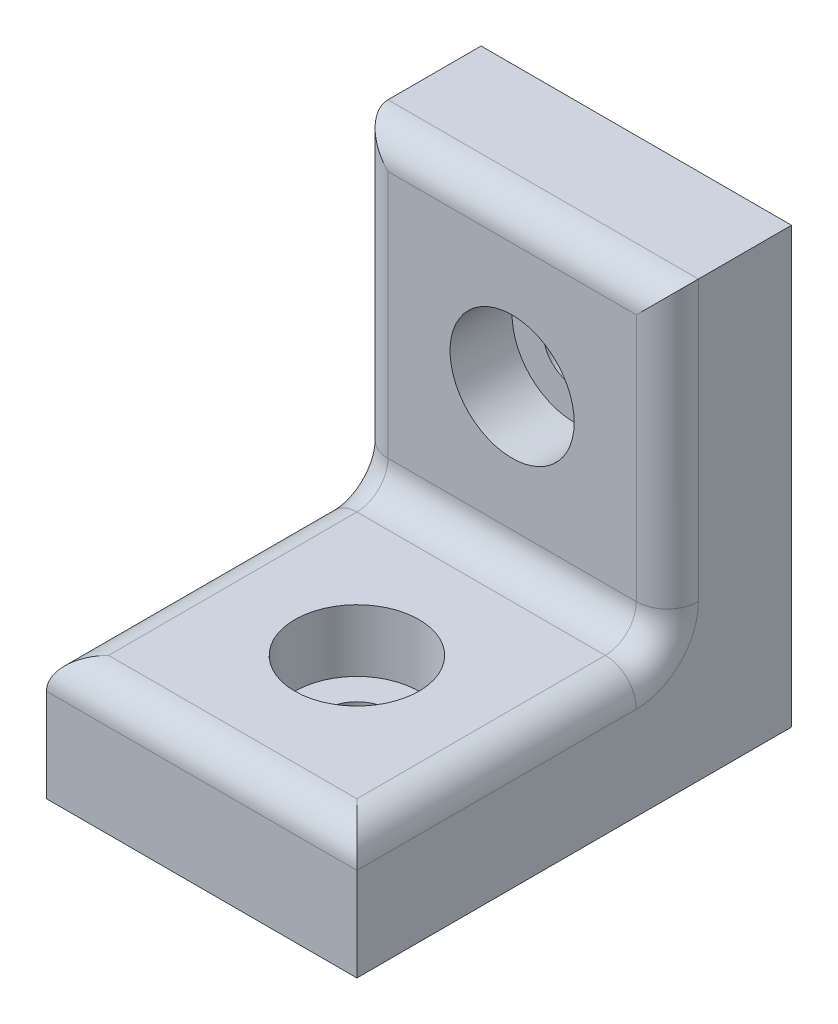
ISO-10303-21;
HEADER;
FILE_DESCRIPTION(('STEP AP214'),'2;1');
FILE_NAME('part.step','',(''),(''),'','','');
FILE_SCHEMA(('AUTOMOTIVE_DESIGN { 1 0 10303 214 1 1 1 1 }'));
ENDSEC;
DATA;
#1=APPLICATION_CONTEXT('core data for automotive mechanical design processes');
#2=APPLICATION_PROTOCOL_DEFINITION('international standard','automotive_design',2000,#1);
#3=PRODUCT_CONTEXT('',#1,'mechanical');
#4=PRODUCT('Part','Part','',(#3));
#5=PRODUCT_RELATED_PRODUCT_CATEGORY('part','',(#4));
#6=PRODUCT_DEFINITION_FORMATION('','',#4);
#7=PRODUCT_DEFINITION_CONTEXT('part definition',#1,'design');
#8=PRODUCT_DEFINITION('design','',#6,#7);
#9=PRODUCT_DEFINITION_SHAPE('','',#8);
#10=(LENGTH_UNIT() NAMED_UNIT(*) SI_UNIT(.MILLI.,.METRE.));
#11=(NAMED_UNIT(*) PLANE_ANGLE_UNIT() SI_UNIT($,.RADIAN.));
#12=(NAMED_UNIT(*) SI_UNIT($,.STERADIAN.) SOLID_ANGLE_UNIT());
#13=UNCERTAINTY_MEASURE_WITH_UNIT(LENGTH_MEASURE(1.E-05),#10,'distance_accuracy_value','');
#14=(GEOMETRIC_REPRESENTATION_CONTEXT(3) GLOBAL_UNCERTAINTY_ASSIGNED_CONTEXT((#13)) GLOBAL_UNIT_ASSIGNED_CONTEXT((#10,
#11,#12)) REPRESENTATION_CONTEXT('',''));
#15=CARTESIAN_POINT('',(0.,0.,0.));
#16=DIRECTION('',(0.,0.,1.));
#17=DIRECTION('',(1.,0.,0.));
#18=AXIS2_PLACEMENT_3D('',#15,#16,#17);
#19=CARTESIAN_POINT('',(0.,0.,9.));
#20=DIRECTION('',(0.,1.,0.));
#21=DIRECTION('',(0.,0.,1.));
#22=AXIS2_PLACEMENT_3D('',#19,#20,#21);
#23=CYLINDRICAL_SURFACE('',#22,1.);
#24=CARTESIAN_POINT('',(0.,0.,9.));
#25=DIRECTION('',(0.,1.,0.));
#26=DIRECTION('',(0.,0.,1.));
#27=AXIS2_PLACEMENT_3D('',#24,#25,#26);
#28=CIRCLE('',#27,1.);
#29=CARTESIAN_POINT('',(0.,0.,10.));
#30=VERTEX_POINT('',#29);
#31=EDGE_CURVE('E200',#30,#30,#28,.T.);
#32=ORIENTED_EDGE('',*,*,#31,.F.);
#33=EDGE_LOOP('',(#32));
#34=FACE_BOUND('',#33,.T.);
#35=CARTESIAN_POINT('',(0.,2.,9.));
#36=DIRECTION('',(0.,1.,0.));
#37=DIRECTION('',(0.,0.,1.));
#38=AXIS2_PLACEMENT_3D('',#35,#36,#37);
#39=CIRCLE('',#38,1.);
#40=CARTESIAN_POINT('',(0.,2.,10.));
#41=VERTEX_POINT('',#40);
#42=EDGE_CURVE('E42',#41,#41,#39,.F.);
#43=ORIENTED_EDGE('',*,*,#42,.F.);
#44=EDGE_LOOP('',(#43));
#45=FACE_BOUND('',#44,.T.);
#46=ADVANCED_FACE('F38',(#34,#45),#23,.F.);
#47=CARTESIAN_POINT('',(0.,9.,0.));
#48=DIRECTION('',(0.,0.,1.));
#49=DIRECTION('',(1.,0.,0.));
#50=AXIS2_PLACEMENT_3D('',#47,#48,#49);
#51=CYLINDRICAL_SURFACE('',#50,1.);
#52=CARTESIAN_POINT('',(0.,9.,0.));
#53=DIRECTION('',(0.,0.,1.));
#54=DIRECTION('',(1.,0.,0.));
#55=AXIS2_PLACEMENT_3D('',#52,#53,#54);
#56=CIRCLE('',#55,1.);
#57=CARTESIAN_POINT('',(1.,9.,0.));
#58=VERTEX_POINT('',#57);
#59=EDGE_CURVE('E135',#58,#58,#56,.T.);
#60=ORIENTED_EDGE('',*,*,#59,.F.);
#61=EDGE_LOOP('',(#60));
#62=FACE_BOUND('',#61,.T.);
#63=CARTESIAN_POINT('',(0.,9.,2.));
#64=DIRECTION('',(0.,0.,1.));
#65=DIRECTION('',(1.,0.,0.));
#66=AXIS2_PLACEMENT_3D('',#63,#64,#65);
#67=CIRCLE('',#66,1.);
#68=CARTESIAN_POINT('',(1.,9.,2.));
#69=VERTEX_POINT('',#68);
#70=EDGE_CURVE('E224',#69,#69,#67,.F.);
#71=ORIENTED_EDGE('',*,*,#70,.F.);
#72=EDGE_LOOP('',(#71));
#73=FACE_BOUND('',#72,.T.);
#74=ADVANCED_FACE('F247',(#62,#73),#51,.F.);
#75=CARTESIAN_POINT('',(-5.,14.,4.));
#76=DIRECTION('',(1.,0.,0.));
#77=DIRECTION('',(0.,1.,0.));
#78=AXIS2_PLACEMENT_3D('',#75,#76,#77);
#79=PLANE('',#78);
#80=CARTESIAN_POINT('',(-5.,5.,5.));
#81=DIRECTION('',(1.,0.,0.));
#82=DIRECTION('',(0.,1.,0.));
#83=AXIS2_PLACEMENT_3D('',#80,#81,#82);
#84=CIRCLE('',#83,2.);
#85=CARTESIAN_POINT('',(-5.,5.,3.));
#86=VERTEX_POINT('',#85);
#87=CARTESIAN_POINT('',(-5.,3.,5.));
#88=VERTEX_POINT('',#87);
#89=EDGE_CURVE('E184',#86,#88,#84,.F.);
#90=ORIENTED_EDGE('',*,*,#89,.F.);
#91=DIRECTION('',(0.,-1.,0.));
#92=VECTOR('',#91,1.);
#93=CARTESIAN_POINT('',(-5.,14.,3.));
#94=LINE('',#93,#92);
#95=CARTESIAN_POINT('',(-5.,14.,3.));
#96=VERTEX_POINT('',#95);
#97=EDGE_CURVE('E189',#86,#96,#94,.F.);
#98=ORIENTED_EDGE('',*,*,#97,.T.);
#99=DIRECTION('',(0.,0.,-1.));
#100=VECTOR('',#99,1.);
#101=CARTESIAN_POINT('',(-5.,14.,4.));
#102=LINE('',#101,#100);
#103=CARTESIAN_POINT('',(-5.,14.,0.));
#104=VERTEX_POINT('',#103);
#105=EDGE_CURVE('E163',#96,#104,#102,.T.);
#106=ORIENTED_EDGE('',*,*,#105,.T.);
#107=DIRECTION('',(0.,-1.,0.));
#108=VECTOR('',#107,1.);
#109=CARTESIAN_POINT('',(-5.,14.,0.));
#110=LINE('',#109,#108);
#111=CARTESIAN_POINT('',(-5.,0.,0.));
#112=VERTEX_POINT('',#111);
#113=EDGE_CURVE('E142',#104,#112,#110,.T.);
#114=ORIENTED_EDGE('',*,*,#113,.T.);
#115=DIRECTION('',(0.,0.,-1.));
#116=VECTOR('',#115,1.);
#117=CARTESIAN_POINT('',(-5.,0.,4.));
#118=LINE('',#117,#116);
#119=CARTESIAN_POINT('',(-5.,0.,14.));
#120=VERTEX_POINT('',#119);
#121=EDGE_CURVE('E139',#120,#112,#118,.T.);
#122=ORIENTED_EDGE('',*,*,#121,.F.);
#123=DIRECTION('',(0.,-1.,0.));
#124=VECTOR('',#123,1.);
#125=CARTESIAN_POINT('',(-5.,0.,14.));
#126=LINE('',#125,#124);
#127=CARTESIAN_POINT('',(-5.,3.,14.));
#128=VERTEX_POINT('',#127);
#129=EDGE_CURVE('E124',#128,#120,#126,.T.);
#130=ORIENTED_EDGE('',*,*,#129,.F.);
#131=DIRECTION('',(0.,0.,-1.));
#132=VECTOR('',#131,1.);
#133=CARTESIAN_POINT('',(-5.,3.,4.));
#134=LINE('',#133,#132);
#135=EDGE_CURVE('E187',#128,#88,#134,.T.);
#136=ORIENTED_EDGE('',*,*,#135,.T.);
#137=EDGE_LOOP('',(#90,#98,#106,#114,#122,#130,#136));
#138=FACE_BOUND('',#137,.T.);
#139=ADVANCED_FACE('F140',(#138),#79,.F.);
#140=CARTESIAN_POINT('',(-5.,0.,4.));
#141=DIRECTION('',(0.,1.,0.));
#142=DIRECTION('',(0.,0.,1.));
#143=AXIS2_PLACEMENT_3D('',#140,#141,#142);
#144=PLANE('',#143);
#145=ORIENTED_EDGE('',*,*,#31,.T.);
#146=EDGE_LOOP('',(#145));
#147=FACE_BOUND('',#146,.T.);
#148=DIRECTION('',(1.,0.,0.));
#149=VECTOR('',#148,1.);
#150=CARTESIAN_POINT('',(-5.,0.,0.));
#151=LINE('',#150,#149);
#152=CARTESIAN_POINT('',(5.,0.,0.));
#153=VERTEX_POINT('',#152);
#154=EDGE_CURVE('E155',#112,#153,#151,.T.);
#155=ORIENTED_EDGE('',*,*,#154,.T.);
#156=DIRECTION('',(0.,0.,-1.));
#157=VECTOR('',#156,1.);
#158=CARTESIAN_POINT('',(5.,0.,4.));
#159=LINE('',#158,#157);
#160=CARTESIAN_POINT('',(5.,0.,14.));
#161=VERTEX_POINT('',#160);
#162=EDGE_CURVE('E145',#161,#153,#159,.T.);
#163=ORIENTED_EDGE('',*,*,#162,.F.);
#164=DIRECTION('',(1.,0.,0.));
#165=VECTOR('',#164,1.);
#166=CARTESIAN_POINT('',(-5.,0.,14.));
#167=LINE('',#166,#165);
#168=EDGE_CURVE('E129',#120,#161,#167,.T.);
#169=ORIENTED_EDGE('',*,*,#168,.F.);
#170=ORIENTED_EDGE('',*,*,#121,.T.);
#171=EDGE_LOOP('',(#155,#163,#169,#170));
#172=FACE_BOUND('',#171,.T.);
#173=ADVANCED_FACE('F147',(#147,#172),#144,.F.);
#174=CARTESIAN_POINT('',(5.,14.,4.));
#175=DIRECTION('',(-1.,0.,0.));
#176=DIRECTION('',(0.,0.,1.));
#177=AXIS2_PLACEMENT_3D('',#174,#175,#176);
#178=PLANE('',#177);
#179=DIRECTION('',(0.,0.,-1.));
#180=VECTOR('',#179,1.);
#181=CARTESIAN_POINT('',(5.,14.,4.));
#182=LINE('',#181,#180);
#183=CARTESIAN_POINT('',(5.,14.,3.));
#184=VERTEX_POINT('',#183);
#185=CARTESIAN_POINT('',(5.,14.,0.));
#186=VERTEX_POINT('',#185);
#187=EDGE_CURVE('E165',#184,#186,#182,.T.);
#188=ORIENTED_EDGE('',*,*,#187,.F.);
#189=DIRECTION('',(0.,1.,0.));
#190=VECTOR('',#189,1.);
#191=CARTESIAN_POINT('',(5.,4.,3.));
#192=LINE('',#191,#190);
#193=CARTESIAN_POINT('',(5.,5.,3.));
#194=VERTEX_POINT('',#193);
#195=EDGE_CURVE('E181',#184,#194,#192,.F.);
#196=ORIENTED_EDGE('',*,*,#195,.T.);
#197=CARTESIAN_POINT('',(5.,5.,5.));
#198=DIRECTION('',(-1.,0.,0.));
#199=DIRECTION('',(0.,0.,1.));
#200=AXIS2_PLACEMENT_3D('',#197,#198,#199);
#201=CIRCLE('',#200,2.);
#202=CARTESIAN_POINT('',(5.,3.,5.));
#203=VERTEX_POINT('',#202);
#204=EDGE_CURVE('E178',#203,#194,#201,.F.);
#205=ORIENTED_EDGE('',*,*,#204,.F.);
#206=DIRECTION('',(0.,0.,-1.));
#207=VECTOR('',#206,1.);
#208=CARTESIAN_POINT('',(5.,3.,4.));
#209=LINE('',#208,#207);
#210=CARTESIAN_POINT('',(5.,3.,14.));
#211=VERTEX_POINT('',#210);
#212=EDGE_CURVE('E176',#203,#211,#209,.F.);
#213=ORIENTED_EDGE('',*,*,#212,.T.);
#214=DIRECTION('',(0.,1.,0.));
#215=VECTOR('',#214,1.);
#216=CARTESIAN_POINT('',(5.,0.,14.));
#217=LINE('',#216,#215);
#218=EDGE_CURVE('E149',#161,#211,#217,.T.);
#219=ORIENTED_EDGE('',*,*,#218,.F.);
#220=ORIENTED_EDGE('',*,*,#162,.T.);
#221=DIRECTION('',(0.,1.,0.));
#222=VECTOR('',#221,1.);
#223=CARTESIAN_POINT('',(5.,14.,0.));
#224=LINE('',#223,#222);
#225=EDGE_CURVE('E157',#153,#186,#224,.T.);
#226=ORIENTED_EDGE('',*,*,#225,.T.);
#227=EDGE_LOOP('',(#188,#196,#205,#213,#219,#220,#226));
#228=FACE_BOUND('',#227,.T.);
#229=ADVANCED_FACE('F275',(#228),#178,.F.);
#230=CARTESIAN_POINT('',(-5.,14.,4.));
#231=DIRECTION('',(0.,-1.,0.));
#232=DIRECTION('',(0.,0.,-1.));
#233=AXIS2_PLACEMENT_3D('',#230,#231,#232);
#234=PLANE('',#233);
#235=ORIENTED_EDGE('',*,*,#105,.F.);
#236=DIRECTION('',(-1.,0.,0.));
#237=VECTOR('',#236,1.);
#238=CARTESIAN_POINT('',(5.,14.,3.));
#239=LINE('',#238,#237);
#240=EDGE_CURVE('E12',#96,#184,#239,.F.);
#241=ORIENTED_EDGE('',*,*,#240,.T.);
#242=ORIENTED_EDGE('',*,*,#187,.T.);
#243=DIRECTION('',(-1.,0.,0.));
#244=VECTOR('',#243,1.);
#245=CARTESIAN_POINT('',(-5.,14.,0.));
#246=LINE('',#245,#244);
#247=EDGE_CURVE('E160',#186,#104,#246,.T.);
#248=ORIENTED_EDGE('',*,*,#247,.T.);
#249=EDGE_LOOP('',(#235,#241,#242,#248));
#250=FACE_BOUND('',#249,.T.);
#251=ADVANCED_FACE('F269',(#250),#234,.F.);
#252=CARTESIAN_POINT('',(0.,0.,4.));
#253=DIRECTION('',(0.,0.,1.));
#254=DIRECTION('',(1.,0.,0.));
#255=AXIS2_PLACEMENT_3D('',#252,#253,#254);
#256=PLANE('',#255);
#257=CARTESIAN_POINT('',(0.,9.,4.));
#258=DIRECTION('',(0.,0.,1.));
#259=DIRECTION('',(1.,0.,0.));
#260=AXIS2_PLACEMENT_3D('',#257,#258,#259);
#261=CIRCLE('',#260,2.);
#262=CARTESIAN_POINT('',(2.,9.,4.));
#263=VERTEX_POINT('',#262);
#264=EDGE_CURVE('E232',#263,#263,#261,.T.);
#265=ORIENTED_EDGE('',*,*,#264,.F.);
#266=EDGE_LOOP('',(#265));
#267=FACE_BOUND('',#266,.T.);
#268=DIRECTION('',(0.,1.,0.));
#269=VECTOR('',#268,1.);
#270=CARTESIAN_POINT('',(4.,14.,4.));
#271=LINE('',#270,#269);
#272=CARTESIAN_POINT('',(4.,5.,4.));
#273=VERTEX_POINT('',#272);
#274=CARTESIAN_POINT('',(4.,13.,4.));
#275=VERTEX_POINT('',#274);
#276=EDGE_CURVE('E171',#273,#275,#271,.T.);
#277=ORIENTED_EDGE('',*,*,#276,.T.);
#278=DIRECTION('',(-1.,0.,0.));
#279=VECTOR('',#278,1.);
#280=CARTESIAN_POINT('',(-5.,13.,4.));
#281=LINE('',#280,#279);
#282=CARTESIAN_POINT('',(-4.,13.,4.));
#283=VERTEX_POINT('',#282);
#284=EDGE_CURVE('E174',#275,#283,#281,.T.);
#285=ORIENTED_EDGE('',*,*,#284,.T.);
#286=DIRECTION('',(0.,-1.,0.));
#287=VECTOR('',#286,1.);
#288=CARTESIAN_POINT('',(-4.,4.,4.));
#289=LINE('',#288,#287);
#290=CARTESIAN_POINT('',(-4.,5.,4.));
#291=VERTEX_POINT('',#290);
#292=EDGE_CURVE('E169',#283,#291,#289,.T.);
#293=ORIENTED_EDGE('',*,*,#292,.T.);
#294=DIRECTION('',(-1.,0.,0.));
#295=VECTOR('',#294,1.);
#296=CARTESIAN_POINT('',(0.,5.,4.));
#297=LINE('',#296,#295);
#298=EDGE_CURVE('E144',#291,#273,#297,.F.);
#299=ORIENTED_EDGE('',*,*,#298,.T.);
#300=EDGE_LOOP('',(#277,#285,#293,#299));
#301=FACE_BOUND('',#300,.T.);
#302=ADVANCED_FACE('F266',(#267,#301),#256,.T.);
#303=CARTESIAN_POINT('',(0.,0.,0.));
#304=DIRECTION('',(0.,0.,1.));
#305=DIRECTION('',(1.,0.,0.));
#306=AXIS2_PLACEMENT_3D('',#303,#304,#305);
#307=PLANE('',#306);
#308=ORIENTED_EDGE('',*,*,#59,.T.);
#309=EDGE_LOOP('',(#308));
#310=FACE_BOUND('',#309,.T.);
#311=ORIENTED_EDGE('',*,*,#113,.F.);
#312=ORIENTED_EDGE('',*,*,#247,.F.);
#313=ORIENTED_EDGE('',*,*,#225,.F.);
#314=ORIENTED_EDGE('',*,*,#154,.F.);
#315=EDGE_LOOP('',(#311,#312,#313,#314));
#316=FACE_BOUND('',#315,.T.);
#317=ADVANCED_FACE('F244',(#310,#316),#307,.F.);
#318=CARTESIAN_POINT('',(-5.,4.,14.));
#319=DIRECTION('',(0.,-1.,0.));
#320=DIRECTION('',(0.,0.,-1.));
#321=AXIS2_PLACEMENT_3D('',#318,#319,#320);
#322=PLANE('',#321);
#323=CARTESIAN_POINT('',(0.,4.,9.));
#324=DIRECTION('',(0.,1.,0.));
#325=DIRECTION('',(0.,0.,1.));
#326=AXIS2_PLACEMENT_3D('',#323,#324,#325);
#327=CIRCLE('',#326,2.);
#328=CARTESIAN_POINT('',(0.,4.,11.));
#329=VERTEX_POINT('',#328);
#330=EDGE_CURVE('E239',#329,#329,#327,.T.);
#331=ORIENTED_EDGE('',*,*,#330,.F.);
#332=EDGE_LOOP('',(#331));
#333=FACE_BOUND('',#332,.T.);
#334=DIRECTION('',(0.,0.,-1.));
#335=VECTOR('',#334,1.);
#336=CARTESIAN_POINT('',(-4.,4.,14.));
#337=LINE('',#336,#335);
#338=CARTESIAN_POINT('',(-4.,4.,5.));
#339=VERTEX_POINT('',#338);
#340=CARTESIAN_POINT('',(-4.,4.,13.));
#341=VERTEX_POINT('',#340);
#342=EDGE_CURVE('E63',#339,#341,#337,.F.);
#343=ORIENTED_EDGE('',*,*,#342,.T.);
#344=DIRECTION('',(-1.,0.,0.));
#345=VECTOR('',#344,1.);
#346=CARTESIAN_POINT('',(-5.,4.,13.));
#347=LINE('',#346,#345);
#348=CARTESIAN_POINT('',(4.,4.,13.));
#349=VERTEX_POINT('',#348);
#350=EDGE_CURVE('E47',#341,#349,#347,.F.);
#351=ORIENTED_EDGE('',*,*,#350,.T.);
#352=DIRECTION('',(0.,0.,-1.));
#353=VECTOR('',#352,1.);
#354=CARTESIAN_POINT('',(4.,4.,14.));
#355=LINE('',#354,#353);
#356=CARTESIAN_POINT('',(4.,4.,5.));
#357=VERTEX_POINT('',#356);
#358=EDGE_CURVE('E55',#349,#357,#355,.T.);
#359=ORIENTED_EDGE('',*,*,#358,.T.);
#360=DIRECTION('',(-1.,0.,0.));
#361=VECTOR('',#360,1.);
#362=CARTESIAN_POINT('',(-5.,4.,5.));
#363=LINE('',#362,#361);
#364=EDGE_CURVE('E192',#357,#339,#363,.T.);
#365=ORIENTED_EDGE('',*,*,#364,.T.);
#366=EDGE_LOOP('',(#343,#351,#359,#365));
#367=FACE_BOUND('',#366,.T.);
#368=ADVANCED_FACE('F262',(#333,#367),#322,.F.);
#369=CARTESIAN_POINT('',(0.,0.,14.));
#370=DIRECTION('',(0.,0.,-1.));
#371=DIRECTION('',(-1.,0.,0.));
#372=AXIS2_PLACEMENT_3D('',#369,#370,#371);
#373=PLANE('',#372);
#374=ORIENTED_EDGE('',*,*,#218,.T.);
#375=DIRECTION('',(-1.,0.,0.));
#376=VECTOR('',#375,1.);
#377=CARTESIAN_POINT('',(0.,3.,14.));
#378=LINE('',#377,#376);
#379=EDGE_CURVE('E132',#211,#128,#378,.T.);
#380=ORIENTED_EDGE('',*,*,#379,.T.);
#381=ORIENTED_EDGE('',*,*,#129,.T.);
#382=ORIENTED_EDGE('',*,*,#168,.T.);
#383=EDGE_LOOP('',(#374,#380,#381,#382));
#384=FACE_BOUND('',#383,.T.);
#385=ADVANCED_FACE('F127',(#384),#373,.F.);
#386=CARTESIAN_POINT('',(-4.,3.,4.));
#387=DIRECTION('',(0.,0.,-1.));
#388=DIRECTION('',(-1.,0.,0.));
#389=AXIS2_PLACEMENT_3D('',#386,#387,#388);
#390=CYLINDRICAL_SURFACE('',#389,1.);
#391=CARTESIAN_POINT('',(-4.,3.,5.));
#392=DIRECTION('',(0.,0.,-1.));
#393=DIRECTION('',(-1.,0.,0.));
#394=AXIS2_PLACEMENT_3D('',#391,#392,#393);
#395=CIRCLE('',#394,1.);
#396=EDGE_CURVE('E219',#88,#339,#395,.T.);
#397=ORIENTED_EDGE('',*,*,#396,.F.);
#398=ORIENTED_EDGE('',*,*,#135,.F.);
#399=CARTESIAN_POINT('',(-4.,3.,13.));
#400=DIRECTION('',(-0.707106781186547,0.,-0.707106781186547));
#401=DIRECTION('',(0.707106781186547,0.,-0.707106781186547));
#402=AXIS2_PLACEMENT_3D('',#399,#400,#401);
#403=ELLIPSE('',#402,1.41421356237309,1.);
#404=EDGE_CURVE('E222',#341,#128,#403,.F.);
#405=ORIENTED_EDGE('',*,*,#404,.F.);
#406=ORIENTED_EDGE('',*,*,#342,.F.);
#407=EDGE_LOOP('',(#397,#398,#405,#406));
#408=FACE_BOUND('',#407,.T.);
#409=ADVANCED_FACE('F40',(#408),#390,.T.);
#410=CARTESIAN_POINT('',(0.,3.,13.));
#411=DIRECTION('',(-1.,0.,0.));
#412=DIRECTION('',(0.,0.,1.));
#413=AXIS2_PLACEMENT_3D('',#410,#411,#412);
#414=CYLINDRICAL_SURFACE('',#413,1.);
#415=ORIENTED_EDGE('',*,*,#404,.T.);
#416=ORIENTED_EDGE('',*,*,#379,.F.);
#417=CARTESIAN_POINT('',(4.,3.,13.));
#418=DIRECTION('',(0.707106781186547,0.,-0.707106781186547));
#419=DIRECTION('',(-0.707106781186547,0.,-0.707106781186547));
#420=AXIS2_PLACEMENT_3D('',#417,#418,#419);
#421=ELLIPSE('',#420,1.41421356237309,1.);
#422=EDGE_CURVE('E217',#349,#211,#421,.T.);
#423=ORIENTED_EDGE('',*,*,#422,.F.);
#424=ORIENTED_EDGE('',*,*,#350,.F.);
#425=EDGE_LOOP('',(#415,#416,#423,#424));
#426=FACE_BOUND('',#425,.T.);
#427=ADVANCED_FACE('F309',(#426),#414,.T.);
#428=CARTESIAN_POINT('',(-4.,5.,5.));
#429=DIRECTION('',(1.,0.,0.));
#430=DIRECTION('',(0.,1.,0.));
#431=AXIS2_PLACEMENT_3D('',#428,#429,#430);
#432=TOROIDAL_SURFACE('',#431,2.,1.);
#433=ORIENTED_EDGE('',*,*,#89,.T.);
#434=ORIENTED_EDGE('',*,*,#396,.T.);
#435=CARTESIAN_POINT('',(-4.,5.,5.));
#436=DIRECTION('',(1.,0.,0.));
#437=DIRECTION('',(0.,1.,0.));
#438=AXIS2_PLACEMENT_3D('',#435,#436,#437);
#439=CIRCLE('',#438,1.);
#440=EDGE_CURVE('E214',#291,#339,#439,.F.);
#441=ORIENTED_EDGE('',*,*,#440,.F.);
#442=CARTESIAN_POINT('',(-4.,5.,3.));
#443=DIRECTION('',(0.,-1.,0.));
#444=DIRECTION('',(0.,0.,-1.));
#445=AXIS2_PLACEMENT_3D('',#442,#443,#444);
#446=CIRCLE('',#445,1.);
#447=EDGE_CURVE('E211',#86,#291,#446,.F.);
#448=ORIENTED_EDGE('',*,*,#447,.F.);
#449=EDGE_LOOP('',(#433,#434,#441,#448));
#450=FACE_BOUND('',#449,.T.);
#451=ADVANCED_FACE('F307',(#450),#432,.T.);
#452=CARTESIAN_POINT('',(4.,3.,14.));
#453=DIRECTION('',(0.,0.,-1.));
#454=DIRECTION('',(-1.,0.,0.));
#455=AXIS2_PLACEMENT_3D('',#452,#453,#454);
#456=CYLINDRICAL_SURFACE('',#455,1.);
#457=ORIENTED_EDGE('',*,*,#422,.T.);
#458=ORIENTED_EDGE('',*,*,#212,.F.);
#459=CARTESIAN_POINT('',(4.,3.,5.));
#460=DIRECTION('',(0.,0.,-1.));
#461=DIRECTION('',(-1.,0.,0.));
#462=AXIS2_PLACEMENT_3D('',#459,#460,#461);
#463=CIRCLE('',#462,1.);
#464=EDGE_CURVE('E208',#357,#203,#463,.T.);
#465=ORIENTED_EDGE('',*,*,#464,.F.);
#466=ORIENTED_EDGE('',*,*,#358,.F.);
#467=EDGE_LOOP('',(#457,#458,#465,#466));
#468=FACE_BOUND('',#467,.T.);
#469=ADVANCED_FACE('F303',(#468),#456,.T.);
#470=CARTESIAN_POINT('',(-5.,5.,5.));
#471=DIRECTION('',(-1.,0.,0.));
#472=DIRECTION('',(0.,0.,1.));
#473=AXIS2_PLACEMENT_3D('',#470,#471,#472);
#474=CYLINDRICAL_SURFACE('',#473,1.);
#475=ORIENTED_EDGE('',*,*,#440,.T.);
#476=ORIENTED_EDGE('',*,*,#364,.F.);
#477=CARTESIAN_POINT('',(4.,5.,5.));
#478=DIRECTION('',(-1.,0.,0.));
#479=DIRECTION('',(0.,0.,1.));
#480=AXIS2_PLACEMENT_3D('',#477,#478,#479);
#481=CIRCLE('',#480,1.);
#482=EDGE_CURVE('E205',#273,#357,#481,.T.);
#483=ORIENTED_EDGE('',*,*,#482,.F.);
#484=ORIENTED_EDGE('',*,*,#298,.F.);
#485=EDGE_LOOP('',(#475,#476,#483,#484));
#486=FACE_BOUND('',#485,.T.);
#487=ADVANCED_FACE('F299',(#486),#474,.F.);
#488=CARTESIAN_POINT('',(-4.,0.,3.));
#489=DIRECTION('',(0.,1.,0.));
#490=DIRECTION('',(-1.,0.,0.));
#491=AXIS2_PLACEMENT_3D('',#488,#489,#490);
#492=CYLINDRICAL_SURFACE('',#491,1.);
#493=ORIENTED_EDGE('',*,*,#447,.T.);
#494=ORIENTED_EDGE('',*,*,#292,.F.);
#495=CARTESIAN_POINT('',(-4.,13.,3.));
#496=DIRECTION('',(0.707106781186547,0.707106781186548,0.));
#497=DIRECTION('',(0.707106781186547,-0.707106781186547,0.));
#498=AXIS2_PLACEMENT_3D('',#495,#496,#497);
#499=ELLIPSE('',#498,1.4142135623731,1.);
#500=EDGE_CURVE('E202',#96,#283,#499,.T.);
#501=ORIENTED_EDGE('',*,*,#500,.F.);
#502=ORIENTED_EDGE('',*,*,#97,.F.);
#503=EDGE_LOOP('',(#493,#494,#501,#502));
#504=FACE_BOUND('',#503,.T.);
#505=ADVANCED_FACE('F295',(#504),#492,.T.);
#506=CARTESIAN_POINT('',(4.,5.,5.));
#507=DIRECTION('',(-1.,0.,0.));
#508=DIRECTION('',(0.,0.,1.));
#509=AXIS2_PLACEMENT_3D('',#506,#507,#508);
#510=TOROIDAL_SURFACE('',#509,2.,1.);
#511=ORIENTED_EDGE('',*,*,#464,.T.);
#512=ORIENTED_EDGE('',*,*,#204,.T.);
#513=CARTESIAN_POINT('',(4.,5.,3.));
#514=DIRECTION('',(0.,-1.,0.));
#515=DIRECTION('',(0.,0.,-1.));
#516=AXIS2_PLACEMENT_3D('',#513,#514,#515);
#517=CIRCLE('',#516,1.);
#518=EDGE_CURVE('E199',#273,#194,#517,.F.);
#519=ORIENTED_EDGE('',*,*,#518,.F.);
#520=ORIENTED_EDGE('',*,*,#482,.T.);
#521=EDGE_LOOP('',(#511,#512,#519,#520));
#522=FACE_BOUND('',#521,.T.);
#523=ADVANCED_FACE('F291',(#522),#510,.T.);
#524=CARTESIAN_POINT('',(0.,13.,3.));
#525=DIRECTION('',(1.,0.,0.));
#526=DIRECTION('',(0.,0.,-1.));
#527=AXIS2_PLACEMENT_3D('',#524,#525,#526);
#528=CYLINDRICAL_SURFACE('',#527,1.);
#529=ORIENTED_EDGE('',*,*,#500,.T.);
#530=ORIENTED_EDGE('',*,*,#284,.F.);
#531=CARTESIAN_POINT('',(4.,13.,3.));
#532=DIRECTION('',(0.707106781186547,-0.707106781186547,0.));
#533=DIRECTION('',(0.707106781186547,0.707106781186547,0.));
#534=AXIS2_PLACEMENT_3D('',#531,#532,#533);
#535=ELLIPSE('',#534,1.41421356237309,1.);
#536=EDGE_CURVE('E197',#184,#275,#535,.T.);
#537=ORIENTED_EDGE('',*,*,#536,.F.);
#538=ORIENTED_EDGE('',*,*,#240,.F.);
#539=EDGE_LOOP('',(#529,#530,#537,#538));
#540=FACE_BOUND('',#539,.T.);
#541=ADVANCED_FACE('F287',(#540),#528,.T.);
#542=CARTESIAN_POINT('',(4.,0.,3.));
#543=DIRECTION('',(0.,-1.,0.));
#544=DIRECTION('',(0.,0.,-1.));
#545=AXIS2_PLACEMENT_3D('',#542,#543,#544);
#546=CYLINDRICAL_SURFACE('',#545,1.);
#547=ORIENTED_EDGE('',*,*,#518,.T.);
#548=ORIENTED_EDGE('',*,*,#195,.F.);
#549=ORIENTED_EDGE('',*,*,#536,.T.);
#550=ORIENTED_EDGE('',*,*,#276,.F.);
#551=EDGE_LOOP('',(#547,#548,#549,#550));
#552=FACE_BOUND('',#551,.T.);
#553=ADVANCED_FACE('F283',(#552),#546,.T.);
#554=CARTESIAN_POINT('',(0.,9.,2.));
#555=DIRECTION('',(0.,0.,1.));
#556=DIRECTION('',(1.,0.,0.));
#557=AXIS2_PLACEMENT_3D('',#554,#555,#556);
#558=PLANE('',#557);
#559=CARTESIAN_POINT('',(0.,9.,2.));
#560=DIRECTION('',(0.,0.,1.));
#561=DIRECTION('',(1.,0.,0.));
#562=AXIS2_PLACEMENT_3D('',#559,#560,#561);
#563=CIRCLE('',#562,2.);
#564=CARTESIAN_POINT('',(2.,9.,2.));
#565=VERTEX_POINT('',#564);
#566=EDGE_CURVE('E226',#565,#565,#563,.T.);
#567=ORIENTED_EDGE('',*,*,#566,.T.);
#568=EDGE_LOOP('',(#567));
#569=FACE_BOUND('',#568,.T.);
#570=ORIENTED_EDGE('',*,*,#70,.T.);
#571=EDGE_LOOP('',(#570));
#572=FACE_BOUND('',#571,.T.);
#573=ADVANCED_FACE('F286',(#569,#572),#558,.T.);
#574=CARTESIAN_POINT('',(0.,9.,2.));
#575=DIRECTION('',(0.,0.,1.));
#576=DIRECTION('',(1.,0.,0.));
#577=AXIS2_PLACEMENT_3D('',#574,#575,#576);
#578=CYLINDRICAL_SURFACE('',#577,2.);
#579=ORIENTED_EDGE('',*,*,#566,.F.);
#580=EDGE_LOOP('',(#579));
#581=FACE_BOUND('',#580,.T.);
#582=ORIENTED_EDGE('',*,*,#264,.T.);
#583=EDGE_LOOP('',(#582));
#584=FACE_BOUND('',#583,.T.);
#585=ADVANCED_FACE('F453',(#581,#584),#578,.F.);
#586=CARTESIAN_POINT('',(0.,2.,9.));
#587=DIRECTION('',(0.,1.,0.));
#588=DIRECTION('',(0.,0.,1.));
#589=AXIS2_PLACEMENT_3D('',#586,#587,#588);
#590=PLANE('',#589);
#591=CARTESIAN_POINT('',(0.,2.,9.));
#592=DIRECTION('',(0.,1.,0.));
#593=DIRECTION('',(0.,0.,1.));
#594=AXIS2_PLACEMENT_3D('',#591,#592,#593);
#595=CIRCLE('',#594,2.);
#596=CARTESIAN_POINT('',(0.,2.,11.));
#597=VERTEX_POINT('',#596);
#598=EDGE_CURVE('E497',#597,#597,#595,.T.);
#599=ORIENTED_EDGE('',*,*,#598,.T.);
#600=EDGE_LOOP('',(#599));
#601=FACE_BOUND('',#600,.T.);
#602=ORIENTED_EDGE('',*,*,#42,.T.);
#603=EDGE_LOOP('',(#602));
#604=FACE_BOUND('',#603,.T.);
#605=ADVANCED_FACE('F461',(#601,#604),#590,.T.);
#606=CARTESIAN_POINT('',(0.,2.,9.));
#607=DIRECTION('',(0.,1.,0.));
#608=DIRECTION('',(0.,0.,1.));
#609=AXIS2_PLACEMENT_3D('',#606,#607,#608);
#610=CYLINDRICAL_SURFACE('',#609,2.);
#611=ORIENTED_EDGE('',*,*,#598,.F.);
#612=EDGE_LOOP('',(#611));
#613=FACE_BOUND('',#612,.T.);
#614=ORIENTED_EDGE('',*,*,#330,.T.);
#615=EDGE_LOOP('',(#614));
#616=FACE_BOUND('',#615,.T.);
#617=ADVANCED_FACE('F472',(#613,#616),#610,.F.);
#618=CLOSED_SHELL('',(#46,#74,#139,#173,#229,#251,#302,#317,#368,#385,#409,#427,#451,#469,#487,
#505,#523,#541,#553,#573,#585,#605,#617));
#619=MANIFOLD_SOLID_BREP('B2',#618);
#620=ADVANCED_BREP_SHAPE_REPRESENTATION('',(#18,#619),#14);
#621=SHAPE_DEFINITION_REPRESENTATION(#9,#620);
ENDSEC;
END-ISO-10303-21;
